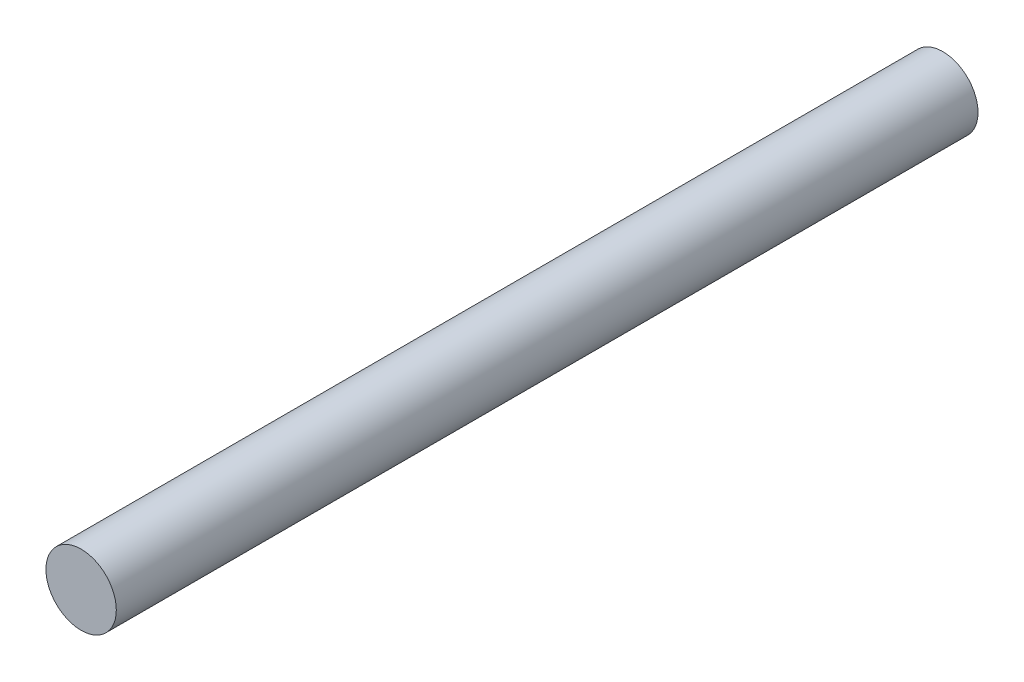
ISO-10303-21;
HEADER;
FILE_DESCRIPTION(('STEP AP214'),'2;1');
FILE_NAME('part.step','',(''),(''),'','','');
FILE_SCHEMA(('AUTOMOTIVE_DESIGN { 1 0 10303 214 1 1 1 1 }'));
ENDSEC;
DATA;
#1=APPLICATION_CONTEXT('core data for automotive mechanical design processes');
#2=APPLICATION_PROTOCOL_DEFINITION('international standard','automotive_design',2000,#1);
#3=PRODUCT_CONTEXT('',#1,'mechanical');
#4=PRODUCT('Part','Part','',(#3));
#5=PRODUCT_RELATED_PRODUCT_CATEGORY('part','',(#4));
#6=PRODUCT_DEFINITION_FORMATION('','',#4);
#7=PRODUCT_DEFINITION_CONTEXT('part definition',#1,'design');
#8=PRODUCT_DEFINITION('design','',#6,#7);
#9=PRODUCT_DEFINITION_SHAPE('','',#8);
#10=(LENGTH_UNIT() NAMED_UNIT(*) SI_UNIT(.MILLI.,.METRE.));
#11=(NAMED_UNIT(*) PLANE_ANGLE_UNIT() SI_UNIT($,.RADIAN.));
#12=(NAMED_UNIT(*) SI_UNIT($,.STERADIAN.) SOLID_ANGLE_UNIT());
#13=UNCERTAINTY_MEASURE_WITH_UNIT(LENGTH_MEASURE(1.E-05),#10,'distance_accuracy_value','');
#14=(GEOMETRIC_REPRESENTATION_CONTEXT(3) GLOBAL_UNCERTAINTY_ASSIGNED_CONTEXT((#13)) GLOBAL_UNIT_ASSIGNED_CONTEXT((#10,
#11,#12)) REPRESENTATION_CONTEXT('',''));
#15=CARTESIAN_POINT('',(0.,0.,0.));
#16=DIRECTION('',(0.,0.,1.));
#17=DIRECTION('',(1.,0.,0.));
#18=AXIS2_PLACEMENT_3D('',#15,#16,#17);
#19=CARTESIAN_POINT('',(0.,0.,60.));
#20=DIRECTION('',(0.,0.,-1.));
#21=DIRECTION('',(-1.,0.,0.));
#22=AXIS2_PLACEMENT_3D('',#19,#20,#21);
#23=CYLINDRICAL_SURFACE('',#22,2.45);
#24=CARTESIAN_POINT('',(0.,0.,60.));
#25=DIRECTION('',(0.,0.,1.));
#26=DIRECTION('',(1.,0.,0.));
#27=AXIS2_PLACEMENT_3D('',#24,#25,#26);
#28=CIRCLE('',#27,2.45);
#29=CARTESIAN_POINT('',(2.45,0.,60.));
#30=VERTEX_POINT('',#29);
#31=EDGE_CURVE('E10',#30,#30,#28,.T.);
#32=ORIENTED_EDGE('',*,*,#31,.F.);
#33=EDGE_LOOP('',(#32));
#34=FACE_BOUND('',#33,.T.);
#35=CARTESIAN_POINT('',(0.,0.,0.));
#36=DIRECTION('',(0.,0.,1.));
#37=DIRECTION('',(1.,0.,0.));
#38=AXIS2_PLACEMENT_3D('',#35,#36,#37);
#39=CIRCLE('',#38,2.45);
#40=CARTESIAN_POINT('',(2.45,0.,0.));
#41=VERTEX_POINT('',#40);
#42=EDGE_CURVE('E36',#41,#41,#39,.T.);
#43=ORIENTED_EDGE('',*,*,#42,.T.);
#44=EDGE_LOOP('',(#43));
#45=FACE_BOUND('',#44,.T.);
#46=ADVANCED_FACE('F33',(#34,#45),#23,.T.);
#47=CARTESIAN_POINT('',(0.,0.,60.));
#48=DIRECTION('',(0.,0.,1.));
#49=DIRECTION('',(1.,0.,0.));
#50=AXIS2_PLACEMENT_3D('',#47,#48,#49);
#51=PLANE('',#50);
#52=ORIENTED_EDGE('',*,*,#31,.T.);
#53=EDGE_LOOP('',(#52));
#54=FACE_BOUND('',#53,.T.);
#55=ADVANCED_FACE('F48',(#54),#51,.T.);
#56=CARTESIAN_POINT('',(0.,0.,0.));
#57=DIRECTION('',(0.,0.,1.));
#58=DIRECTION('',(1.,0.,0.));
#59=AXIS2_PLACEMENT_3D('',#56,#57,#58);
#60=PLANE('',#59);
#61=ORIENTED_EDGE('',*,*,#42,.F.);
#62=EDGE_LOOP('',(#61));
#63=FACE_BOUND('',#62,.T.);
#64=ADVANCED_FACE('F46',(#63),#60,.F.);
#65=CLOSED_SHELL('',(#46,#55,#64));
#66=MANIFOLD_SOLID_BREP('B2',#65);
#67=ADVANCED_BREP_SHAPE_REPRESENTATION('',(#18,#66),#14);
#68=SHAPE_DEFINITION_REPRESENTATION(#9,#67);
ENDSEC;
END-ISO-10303-21;
